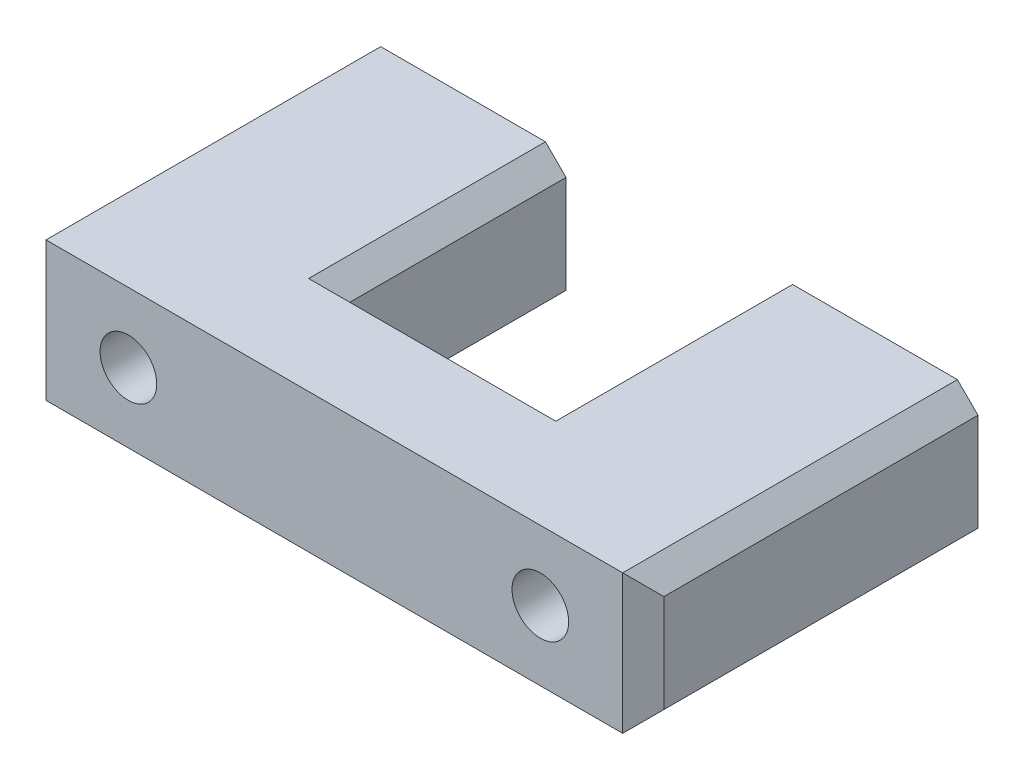
ISO-10303-21;
HEADER;
FILE_DESCRIPTION(('STEP AP214'),'2;1');
FILE_NAME('part.step','',(''),(''),'','','');
FILE_SCHEMA(('AUTOMOTIVE_DESIGN { 1 0 10303 214 1 1 1 1 }'));
ENDSEC;
DATA;
#1=APPLICATION_CONTEXT('core data for automotive mechanical design processes');
#2=APPLICATION_PROTOCOL_DEFINITION('international standard','automotive_design',2000,#1);
#3=PRODUCT_CONTEXT('',#1,'mechanical');
#4=PRODUCT('Part','Part','',(#3));
#5=PRODUCT_RELATED_PRODUCT_CATEGORY('part','',(#4));
#6=PRODUCT_DEFINITION_FORMATION('','',#4);
#7=PRODUCT_DEFINITION_CONTEXT('part definition',#1,'design');
#8=PRODUCT_DEFINITION('design','',#6,#7);
#9=PRODUCT_DEFINITION_SHAPE('','',#8);
#10=(LENGTH_UNIT() NAMED_UNIT(*) SI_UNIT(.MILLI.,.METRE.));
#11=(NAMED_UNIT(*) PLANE_ANGLE_UNIT() SI_UNIT($,.RADIAN.));
#12=(NAMED_UNIT(*) SI_UNIT($,.STERADIAN.) SOLID_ANGLE_UNIT());
#13=UNCERTAINTY_MEASURE_WITH_UNIT(LENGTH_MEASURE(1.E-05),#10,'distance_accuracy_value','');
#14=(GEOMETRIC_REPRESENTATION_CONTEXT(3) GLOBAL_UNCERTAINTY_ASSIGNED_CONTEXT((#13)) GLOBAL_UNIT_ASSIGNED_CONTEXT((#10,
#11,#12)) REPRESENTATION_CONTEXT('',''));
#15=CARTESIAN_POINT('',(0.,0.,0.));
#16=DIRECTION('',(0.,0.,1.));
#17=DIRECTION('',(1.,0.,0.));
#18=AXIS2_PLACEMENT_3D('',#15,#16,#17);
#19=CARTESIAN_POINT('',(0.,0.,0.));
#20=DIRECTION('',(0.,0.,1.));
#21=DIRECTION('',(1.,0.,0.));
#22=AXIS2_PLACEMENT_3D('',#19,#20,#21);
#23=PLANE('',#22);
#24=CARTESIAN_POINT('',(20.,0.,0.));
#25=DIRECTION('',(0.,0.,1.));
#26=DIRECTION('',(1.,0.,0.));
#27=AXIS2_PLACEMENT_3D('',#24,#25,#26);
#28=CIRCLE('',#27,2.75);
#29=CARTESIAN_POINT('',(22.75,0.,0.));
#30=VERTEX_POINT('',#29);
#31=EDGE_CURVE('E345',#30,#30,#28,.T.);
#32=ORIENTED_EDGE('',*,*,#31,.T.);
#33=EDGE_LOOP('',(#32));
#34=FACE_BOUND('',#33,.T.);
#35=DIRECTION('',(1.,0.,0.));
#36=VECTOR('',#35,1.);
#37=CARTESIAN_POINT('',(-30.,-6.75,0.));
#38=LINE('',#37,#36);
#39=CARTESIAN_POINT('',(12.,-6.75,0.));
#40=VERTEX_POINT('',#39);
#41=CARTESIAN_POINT('',(28.,-6.75,0.));
#42=VERTEX_POINT('',#41);
#43=EDGE_CURVE('E198',#40,#42,#38,.T.);
#44=ORIENTED_EDGE('',*,*,#43,.F.);
#45=DIRECTION('',(0.707106781186546,-0.707106781186549,0.));
#46=VECTOR('',#45,1.);
#47=CARTESIAN_POINT('',(12.,-6.75,0.));
#48=LINE('',#47,#46);
#49=CARTESIAN_POINT('',(10.,-4.74999999999998,0.));
#50=VERTEX_POINT('',#49);
#51=EDGE_CURVE('E285',#40,#50,#48,.F.);
#52=ORIENTED_EDGE('',*,*,#51,.T.);
#53=DIRECTION('',(0.,1.,0.));
#54=VECTOR('',#53,1.);
#55=CARTESIAN_POINT('',(10.,-6.75,0.));
#56=LINE('',#55,#54);
#57=CARTESIAN_POINT('',(10.,4.74999999999999,0.));
#58=VERTEX_POINT('',#57);
#59=EDGE_CURVE('E251',#50,#58,#56,.T.);
#60=ORIENTED_EDGE('',*,*,#59,.T.);
#61=DIRECTION('',(-0.707106781186549,-0.707106781186546,0.));
#62=VECTOR('',#61,1.);
#63=CARTESIAN_POINT('',(10.,4.74999999999999,0.));
#64=LINE('',#63,#62);
#65=CARTESIAN_POINT('',(12.,6.75,0.));
#66=VERTEX_POINT('',#65);
#67=EDGE_CURVE('E282',#58,#66,#64,.F.);
#68=ORIENTED_EDGE('',*,*,#67,.T.);
#69=DIRECTION('',(-1.,0.,0.));
#70=VECTOR('',#69,1.);
#71=CARTESIAN_POINT('',(-30.,6.75,0.));
#72=LINE('',#71,#70);
#73=CARTESIAN_POINT('',(28.,6.75,0.));
#74=VERTEX_POINT('',#73);
#75=EDGE_CURVE('E360',#74,#66,#72,.T.);
#76=ORIENTED_EDGE('',*,*,#75,.F.);
#77=DIRECTION('',(-0.707106781186546,0.707106781186549,0.));
#78=VECTOR('',#77,1.);
#79=CARTESIAN_POINT('',(28.,6.75,0.));
#80=LINE('',#79,#78);
#81=CARTESIAN_POINT('',(30.,4.74999999999998,0.));
#82=VERTEX_POINT('',#81);
#83=EDGE_CURVE('E174',#74,#82,#80,.F.);
#84=ORIENTED_EDGE('',*,*,#83,.T.);
#85=DIRECTION('',(0.,1.,0.));
#86=VECTOR('',#85,1.);
#87=CARTESIAN_POINT('',(30.,-6.75,0.));
#88=LINE('',#87,#86);
#89=CARTESIAN_POINT('',(30.,-4.74999999999998,0.));
#90=VERTEX_POINT('',#89);
#91=EDGE_CURVE('E179',#90,#82,#88,.T.);
#92=ORIENTED_EDGE('',*,*,#91,.F.);
#93=DIRECTION('',(0.707106781186546,0.707106781186549,0.));
#94=VECTOR('',#93,1.);
#95=CARTESIAN_POINT('',(30.,-4.74999999999998,0.));
#96=LINE('',#95,#94);
#97=EDGE_CURVE('E163',#90,#42,#96,.F.);
#98=ORIENTED_EDGE('',*,*,#97,.T.);
#99=EDGE_LOOP('',(#44,#52,#60,#68,#76,#84,#92,#98));
#100=FACE_BOUND('',#99,.T.);
#101=ADVANCED_FACE('F47',(#34,#100),#23,.F.);
#102=CARTESIAN_POINT('',(0.,0.,32.5));
#103=DIRECTION('',(0.,0.,1.));
#104=DIRECTION('',(1.,0.,0.));
#105=AXIS2_PLACEMENT_3D('',#102,#103,#104);
#106=PLANE('',#105);
#107=CARTESIAN_POINT('',(-20.,0.,32.5));
#108=DIRECTION('',(0.,0.,1.));
#109=DIRECTION('',(1.,0.,0.));
#110=AXIS2_PLACEMENT_3D('',#107,#108,#109);
#111=CIRCLE('',#110,2.75);
#112=CARTESIAN_POINT('',(-17.25,0.,32.5));
#113=VERTEX_POINT('',#112);
#114=EDGE_CURVE('E349',#113,#113,#111,.T.);
#115=ORIENTED_EDGE('',*,*,#114,.F.);
#116=EDGE_LOOP('',(#115));
#117=FACE_BOUND('',#116,.T.);
#118=DIRECTION('',(1.,0.,0.));
#119=VECTOR('',#118,1.);
#120=CARTESIAN_POINT('',(-30.,-6.75,32.5));
#121=LINE('',#120,#119);
#122=CARTESIAN_POINT('',(-28.,-6.75,32.5));
#123=VERTEX_POINT('',#122);
#124=CARTESIAN_POINT('',(28.,-6.75,32.5));
#125=VERTEX_POINT('',#124);
#126=EDGE_CURVE('E195',#123,#125,#121,.T.);
#127=ORIENTED_EDGE('',*,*,#126,.T.);
#128=DIRECTION('',(0.,1.,0.));
#129=VECTOR('',#128,1.);
#130=CARTESIAN_POINT('',(28.,6.75,32.5));
#131=LINE('',#130,#129);
#132=CARTESIAN_POINT('',(28.,6.75,32.5));
#133=VERTEX_POINT('',#132);
#134=EDGE_CURVE('E217',#125,#133,#131,.T.);
#135=ORIENTED_EDGE('',*,*,#134,.T.);
#136=DIRECTION('',(-1.,0.,0.));
#137=VECTOR('',#136,1.);
#138=CARTESIAN_POINT('',(-30.,6.75,32.5));
#139=LINE('',#138,#137);
#140=CARTESIAN_POINT('',(-28.,6.75,32.5));
#141=VERTEX_POINT('',#140);
#142=EDGE_CURVE('E189',#133,#141,#139,.T.);
#143=ORIENTED_EDGE('',*,*,#142,.T.);
#144=DIRECTION('',(0.,-1.,0.));
#145=VECTOR('',#144,1.);
#146=CARTESIAN_POINT('',(-28.,-6.75,32.5));
#147=LINE('',#146,#145);
#148=EDGE_CURVE('E214',#141,#123,#147,.T.);
#149=ORIENTED_EDGE('',*,*,#148,.T.);
#150=EDGE_LOOP('',(#127,#135,#143,#149));
#151=FACE_BOUND('',#150,.T.);
#152=CARTESIAN_POINT('',(20.,0.,32.5));
#153=DIRECTION('',(0.,0.,1.));
#154=DIRECTION('',(1.,0.,0.));
#155=AXIS2_PLACEMENT_3D('',#152,#153,#154);
#156=CIRCLE('',#155,2.75);
#157=CARTESIAN_POINT('',(22.75,0.,32.5));
#158=VERTEX_POINT('',#157);
#159=EDGE_CURVE('E340',#158,#158,#156,.T.);
#160=ORIENTED_EDGE('',*,*,#159,.F.);
#161=EDGE_LOOP('',(#160));
#162=FACE_BOUND('',#161,.T.);
#163=ADVANCED_FACE('F416',(#117,#151,#162),#106,.T.);
#164=DIRECTION('',(0.,1.,0.));
#165=VECTOR('',#164,1.);
#166=CARTESIAN_POINT('',(-10.,-6.75,0.));
#167=LINE('',#166,#165);
#168=CARTESIAN_POINT('',(-10.,-4.74999999999998,0.));
#169=VERTEX_POINT('',#168);
#170=CARTESIAN_POINT('',(-10.,4.74999999999999,0.));
#171=VERTEX_POINT('',#170);
#172=EDGE_CURVE('E332',#169,#171,#167,.T.);
#173=ORIENTED_EDGE('',*,*,#172,.F.);
#174=DIRECTION('',(0.707106781186546,0.707106781186549,0.));
#175=VECTOR('',#174,1.);
#176=CARTESIAN_POINT('',(-12.,-6.74999999999999,0.));
#177=LINE('',#176,#175);
#178=CARTESIAN_POINT('',(-12.,-6.75,0.));
#179=VERTEX_POINT('',#178);
#180=EDGE_CURVE('E279',#169,#179,#177,.F.);
#181=ORIENTED_EDGE('',*,*,#180,.T.);
#182=CARTESIAN_POINT('',(-28.,-6.75,0.));
#183=VERTEX_POINT('',#182);
#184=EDGE_CURVE('E190',#183,#179,#38,.T.);
#185=ORIENTED_EDGE('',*,*,#184,.F.);
#186=DIRECTION('',(0.707106781186549,-0.707106781186546,0.));
#187=VECTOR('',#186,1.);
#188=CARTESIAN_POINT('',(-28.,-6.75,0.));
#189=LINE('',#188,#187);
#190=CARTESIAN_POINT('',(-30.,-4.74999999999999,0.));
#191=VERTEX_POINT('',#190);
#192=EDGE_CURVE('E230',#183,#191,#189,.F.);
#193=ORIENTED_EDGE('',*,*,#192,.T.);
#194=DIRECTION('',(0.,-1.,0.));
#195=VECTOR('',#194,1.);
#196=CARTESIAN_POINT('',(-30.,-6.75,0.));
#197=LINE('',#196,#195);
#198=CARTESIAN_POINT('',(-30.,4.74999999999999,0.));
#199=VERTEX_POINT('',#198);
#200=EDGE_CURVE('E362',#199,#191,#197,.T.);
#201=ORIENTED_EDGE('',*,*,#200,.F.);
#202=DIRECTION('',(-0.707106781186549,-0.707106781186546,0.));
#203=VECTOR('',#202,1.);
#204=CARTESIAN_POINT('',(-30.,4.74999999999999,0.));
#205=LINE('',#204,#203);
#206=CARTESIAN_POINT('',(-28.,6.75,0.));
#207=VERTEX_POINT('',#206);
#208=EDGE_CURVE('E226',#199,#207,#205,.F.);
#209=ORIENTED_EDGE('',*,*,#208,.T.);
#210=CARTESIAN_POINT('',(-12.,6.75,0.));
#211=VERTEX_POINT('',#210);
#212=EDGE_CURVE('E353',#211,#207,#72,.T.);
#213=ORIENTED_EDGE('',*,*,#212,.F.);
#214=DIRECTION('',(-0.707106781186549,0.707106781186546,0.));
#215=VECTOR('',#214,1.);
#216=CARTESIAN_POINT('',(-10.,4.74999999999999,0.));
#217=LINE('',#216,#215);
#218=EDGE_CURVE('E276',#211,#171,#217,.F.);
#219=ORIENTED_EDGE('',*,*,#218,.T.);
#220=EDGE_LOOP('',(#173,#181,#185,#193,#201,#209,#213,#219));
#221=FACE_BOUND('',#220,.T.);
#222=CARTESIAN_POINT('',(-20.,0.,0.));
#223=DIRECTION('',(0.,0.,1.));
#224=DIRECTION('',(1.,0.,0.));
#225=AXIS2_PLACEMENT_3D('',#222,#223,#224);
#226=CIRCLE('',#225,2.75);
#227=CARTESIAN_POINT('',(-17.25,0.,0.));
#228=VERTEX_POINT('',#227);
#229=EDGE_CURVE('E344',#228,#228,#226,.T.);
#230=ORIENTED_EDGE('',*,*,#229,.T.);
#231=EDGE_LOOP('',(#230));
#232=FACE_BOUND('',#231,.T.);
#233=ADVANCED_FACE('F399',(#221,#232),#23,.F.);
#234=CARTESIAN_POINT('',(-30.,6.75,32.5));
#235=DIRECTION('',(0.,-1.,0.));
#236=DIRECTION('',(0.,0.,-1.));
#237=AXIS2_PLACEMENT_3D('',#234,#235,#236);
#238=PLANE('',#237);
#239=DIRECTION('',(-1.,0.,0.));
#240=VECTOR('',#239,1.);
#241=CARTESIAN_POINT('',(-30.,6.75,23.));
#242=LINE('',#241,#240);
#243=CARTESIAN_POINT('',(12.,6.75,23.));
#244=VERTEX_POINT('',#243);
#245=CARTESIAN_POINT('',(-12.,6.75,23.));
#246=VERTEX_POINT('',#245);
#247=EDGE_CURVE('E58',#244,#246,#242,.T.);
#248=ORIENTED_EDGE('',*,*,#247,.T.);
#249=DIRECTION('',(0.,0.,-1.));
#250=VECTOR('',#249,1.);
#251=CARTESIAN_POINT('',(-12.,6.75,32.5));
#252=LINE('',#251,#250);
#253=EDGE_CURVE('E11',#246,#211,#252,.T.);
#254=ORIENTED_EDGE('',*,*,#253,.T.);
#255=ORIENTED_EDGE('',*,*,#212,.T.);
#256=DIRECTION('',(0.,0.,1.));
#257=VECTOR('',#256,1.);
#258=CARTESIAN_POINT('',(-28.,6.75,32.5));
#259=LINE('',#258,#257);
#260=EDGE_CURVE('E220',#207,#141,#259,.T.);
#261=ORIENTED_EDGE('',*,*,#260,.T.);
#262=ORIENTED_EDGE('',*,*,#142,.F.);
#263=DIRECTION('',(0.,0.,-1.));
#264=VECTOR('',#263,1.);
#265=CARTESIAN_POINT('',(28.,6.75,32.5));
#266=LINE('',#265,#264);
#267=EDGE_CURVE('E223',#133,#74,#266,.T.);
#268=ORIENTED_EDGE('',*,*,#267,.T.);
#269=ORIENTED_EDGE('',*,*,#75,.T.);
#270=DIRECTION('',(0.,0.,1.));
#271=VECTOR('',#270,1.);
#272=CARTESIAN_POINT('',(12.,6.75,32.5));
#273=LINE('',#272,#271);
#274=EDGE_CURVE('E69',#66,#244,#273,.T.);
#275=ORIENTED_EDGE('',*,*,#274,.T.);
#276=EDGE_LOOP('',(#248,#254,#255,#261,#262,#268,#269,#275));
#277=FACE_BOUND('',#276,.T.);
#278=ADVANCED_FACE('F404',(#277),#238,.F.);
#279=CARTESIAN_POINT('',(-30.,-6.75,32.5));
#280=DIRECTION('',(1.,0.,0.));
#281=DIRECTION('',(0.,0.,-1.));
#282=AXIS2_PLACEMENT_3D('',#279,#280,#281);
#283=PLANE('',#282);
#284=ORIENTED_EDGE('',*,*,#200,.T.);
#285=DIRECTION('',(0.,0.,1.));
#286=VECTOR('',#285,1.);
#287=CARTESIAN_POINT('',(-30.,-4.74999999999999,32.5));
#288=LINE('',#287,#286);
#289=CARTESIAN_POINT('',(-30.,-4.74999999999999,30.5));
#290=VERTEX_POINT('',#289);
#291=EDGE_CURVE('E239',#191,#290,#288,.T.);
#292=ORIENTED_EDGE('',*,*,#291,.T.);
#293=DIRECTION('',(0.,1.,0.));
#294=VECTOR('',#293,1.);
#295=CARTESIAN_POINT('',(-30.,6.75,30.5));
#296=LINE('',#295,#294);
#297=CARTESIAN_POINT('',(-30.,4.74999999999999,30.5));
#298=VERTEX_POINT('',#297);
#299=EDGE_CURVE('E236',#290,#298,#296,.T.);
#300=ORIENTED_EDGE('',*,*,#299,.T.);
#301=DIRECTION('',(0.,0.,-1.));
#302=VECTOR('',#301,1.);
#303=CARTESIAN_POINT('',(-30.,4.74999999999999,32.5));
#304=LINE('',#303,#302);
#305=EDGE_CURVE('E233',#298,#199,#304,.T.);
#306=ORIENTED_EDGE('',*,*,#305,.T.);
#307=EDGE_LOOP('',(#284,#292,#300,#306));
#308=FACE_BOUND('',#307,.T.);
#309=ADVANCED_FACE('F449',(#308),#283,.F.);
#310=CARTESIAN_POINT('',(-30.,-6.75,32.5));
#311=DIRECTION('',(0.,1.,0.));
#312=DIRECTION('',(0.,0.,1.));
#313=AXIS2_PLACEMENT_3D('',#310,#311,#312);
#314=PLANE('',#313);
#315=ORIENTED_EDGE('',*,*,#184,.T.);
#316=DIRECTION('',(0.,0.,1.));
#317=VECTOR('',#316,1.);
#318=CARTESIAN_POINT('',(-12.,-6.75,32.5));
#319=LINE('',#318,#317);
#320=CARTESIAN_POINT('',(-12.,-6.75,23.));
#321=VERTEX_POINT('',#320);
#322=EDGE_CURVE('E265',#179,#321,#319,.T.);
#323=ORIENTED_EDGE('',*,*,#322,.T.);
#324=DIRECTION('',(1.,0.,0.));
#325=VECTOR('',#324,1.);
#326=CARTESIAN_POINT('',(-30.,-6.75,23.));
#327=LINE('',#326,#325);
#328=CARTESIAN_POINT('',(12.,-6.75,23.));
#329=VERTEX_POINT('',#328);
#330=EDGE_CURVE('E242',#321,#329,#327,.T.);
#331=ORIENTED_EDGE('',*,*,#330,.T.);
#332=DIRECTION('',(0.,0.,-1.));
#333=VECTOR('',#332,1.);
#334=CARTESIAN_POINT('',(12.,-6.75,32.5));
#335=LINE('',#334,#333);
#336=EDGE_CURVE('E262',#329,#40,#335,.T.);
#337=ORIENTED_EDGE('',*,*,#336,.T.);
#338=ORIENTED_EDGE('',*,*,#43,.T.);
#339=DIRECTION('',(0.,0.,1.));
#340=VECTOR('',#339,1.);
#341=CARTESIAN_POINT('',(28.,-6.75,32.5));
#342=LINE('',#341,#340);
#343=EDGE_CURVE('E168',#42,#125,#342,.T.);
#344=ORIENTED_EDGE('',*,*,#343,.T.);
#345=ORIENTED_EDGE('',*,*,#126,.F.);
#346=DIRECTION('',(0.,0.,-1.));
#347=VECTOR('',#346,1.);
#348=CARTESIAN_POINT('',(-28.,-6.75,32.5));
#349=LINE('',#348,#347);
#350=EDGE_CURVE('E173',#123,#183,#349,.T.);
#351=ORIENTED_EDGE('',*,*,#350,.T.);
#352=EDGE_LOOP('',(#315,#323,#331,#337,#338,#344,#345,#351));
#353=FACE_BOUND('',#352,.T.);
#354=ADVANCED_FACE('F370',(#353),#314,.F.);
#355=CARTESIAN_POINT('',(30.,-6.75,32.5));
#356=DIRECTION('',(-1.,0.,0.));
#357=DIRECTION('',(0.,0.,1.));
#358=AXIS2_PLACEMENT_3D('',#355,#356,#357);
#359=PLANE('',#358);
#360=DIRECTION('',(0.,-1.,0.));
#361=VECTOR('',#360,1.);
#362=CARTESIAN_POINT('',(30.,-6.75,30.5));
#363=LINE('',#362,#361);
#364=CARTESIAN_POINT('',(30.,4.74999999999998,30.5));
#365=VERTEX_POINT('',#364);
#366=CARTESIAN_POINT('',(30.,-4.74999999999998,30.5));
#367=VERTEX_POINT('',#366);
#368=EDGE_CURVE('E182',#365,#367,#363,.T.);
#369=ORIENTED_EDGE('',*,*,#368,.T.);
#370=DIRECTION('',(0.,0.,-1.));
#371=VECTOR('',#370,1.);
#372=CARTESIAN_POINT('',(30.,-4.74999999999998,32.5));
#373=LINE('',#372,#371);
#374=EDGE_CURVE('E167',#367,#90,#373,.T.);
#375=ORIENTED_EDGE('',*,*,#374,.T.);
#376=ORIENTED_EDGE('',*,*,#91,.T.);
#377=DIRECTION('',(0.,0.,1.));
#378=VECTOR('',#377,1.);
#379=CARTESIAN_POINT('',(30.,4.74999999999998,32.5));
#380=LINE('',#379,#378);
#381=EDGE_CURVE('E202',#82,#365,#380,.T.);
#382=ORIENTED_EDGE('',*,*,#381,.T.);
#383=EDGE_LOOP('',(#369,#375,#376,#382));
#384=FACE_BOUND('',#383,.T.);
#385=ADVANCED_FACE('F178',(#384),#359,.F.);
#386=CARTESIAN_POINT('',(-20.,0.,32.5));
#387=DIRECTION('',(0.,0.,-1.));
#388=DIRECTION('',(-1.,0.,0.));
#389=AXIS2_PLACEMENT_3D('',#386,#387,#388);
#390=CYLINDRICAL_SURFACE('',#389,2.75);
#391=ORIENTED_EDGE('',*,*,#114,.T.);
#392=EDGE_LOOP('',(#391));
#393=FACE_BOUND('',#392,.T.);
#394=ORIENTED_EDGE('',*,*,#229,.F.);
#395=EDGE_LOOP('',(#394));
#396=FACE_BOUND('',#395,.T.);
#397=ADVANCED_FACE('F567',(#393,#396),#390,.F.);
#398=CARTESIAN_POINT('',(20.,0.,32.5));
#399=DIRECTION('',(0.,0.,-1.));
#400=DIRECTION('',(-1.,0.,0.));
#401=AXIS2_PLACEMENT_3D('',#398,#399,#400);
#402=CYLINDRICAL_SURFACE('',#401,2.75);
#403=ORIENTED_EDGE('',*,*,#159,.T.);
#404=EDGE_LOOP('',(#403));
#405=FACE_BOUND('',#404,.T.);
#406=ORIENTED_EDGE('',*,*,#31,.F.);
#407=EDGE_LOOP('',(#406));
#408=FACE_BOUND('',#407,.T.);
#409=ADVANCED_FACE('F546',(#405,#408),#402,.F.);
#410=CARTESIAN_POINT('',(10.,-6.75,0.));
#411=DIRECTION('',(1.,0.,0.));
#412=DIRECTION('',(0.,0.,-1.));
#413=AXIS2_PLACEMENT_3D('',#410,#411,#412);
#414=PLANE('',#413);
#415=ORIENTED_EDGE('',*,*,#59,.F.);
#416=DIRECTION('',(0.,0.,1.));
#417=VECTOR('',#416,1.);
#418=CARTESIAN_POINT('',(10.,-4.74999999999998,0.));
#419=LINE('',#418,#417);
#420=CARTESIAN_POINT('',(10.,-4.74999999999998,21.));
#421=VERTEX_POINT('',#420);
#422=EDGE_CURVE('E291',#50,#421,#419,.T.);
#423=ORIENTED_EDGE('',*,*,#422,.T.);
#424=DIRECTION('',(0.,1.,0.));
#425=VECTOR('',#424,1.);
#426=CARTESIAN_POINT('',(10.,-6.75,21.));
#427=LINE('',#426,#425);
#428=CARTESIAN_POINT('',(10.,4.74999999999999,21.));
#429=VERTEX_POINT('',#428);
#430=EDGE_CURVE('E329',#421,#429,#427,.T.);
#431=ORIENTED_EDGE('',*,*,#430,.T.);
#432=DIRECTION('',(0.,0.,-1.));
#433=VECTOR('',#432,1.);
#434=CARTESIAN_POINT('',(10.,4.74999999999999,0.));
#435=LINE('',#434,#433);
#436=EDGE_CURVE('E288',#429,#58,#435,.T.);
#437=ORIENTED_EDGE('',*,*,#436,.T.);
#438=EDGE_LOOP('',(#415,#423,#431,#437));
#439=FACE_BOUND('',#438,.T.);
#440=ADVANCED_FACE('F326',(#439),#414,.F.);
#441=CARTESIAN_POINT('',(10.,-6.75,21.));
#442=DIRECTION('',(0.,0.,1.));
#443=DIRECTION('',(1.,0.,0.));
#444=AXIS2_PLACEMENT_3D('',#441,#442,#443);
#445=PLANE('',#444);
#446=ORIENTED_EDGE('',*,*,#430,.F.);
#447=DIRECTION('',(-1.,0.,0.));
#448=VECTOR('',#447,1.);
#449=CARTESIAN_POINT('',(10.,-4.74999999999998,21.));
#450=LINE('',#449,#448);
#451=CARTESIAN_POINT('',(-9.99999999999999,-4.74999999999998,21.));
#452=VERTEX_POINT('',#451);
#453=EDGE_CURVE('E297',#421,#452,#450,.T.);
#454=ORIENTED_EDGE('',*,*,#453,.T.);
#455=DIRECTION('',(0.,1.,0.));
#456=VECTOR('',#455,1.);
#457=CARTESIAN_POINT('',(-9.99999999999999,-6.75,21.));
#458=LINE('',#457,#456);
#459=CARTESIAN_POINT('',(-9.99999999999999,4.74999999999999,21.));
#460=VERTEX_POINT('',#459);
#461=EDGE_CURVE('E336',#452,#460,#458,.T.);
#462=ORIENTED_EDGE('',*,*,#461,.T.);
#463=DIRECTION('',(1.,0.,0.));
#464=VECTOR('',#463,1.);
#465=CARTESIAN_POINT('',(10.,4.74999999999999,21.));
#466=LINE('',#465,#464);
#467=EDGE_CURVE('E294',#460,#429,#466,.T.);
#468=ORIENTED_EDGE('',*,*,#467,.T.);
#469=EDGE_LOOP('',(#446,#454,#462,#468));
#470=FACE_BOUND('',#469,.T.);
#471=ADVANCED_FACE('F378',(#470),#445,.F.);
#472=CARTESIAN_POINT('',(-10.,-6.75,0.));
#473=DIRECTION('',(-1.,0.,0.));
#474=DIRECTION('',(0.,0.,1.));
#475=AXIS2_PLACEMENT_3D('',#472,#473,#474);
#476=PLANE('',#475);
#477=ORIENTED_EDGE('',*,*,#461,.F.);
#478=DIRECTION('',(0.,0.,-1.));
#479=VECTOR('',#478,1.);
#480=CARTESIAN_POINT('',(-10.,-4.74999999999998,0.));
#481=LINE('',#480,#479);
#482=EDGE_CURVE('E273',#452,#169,#481,.T.);
#483=ORIENTED_EDGE('',*,*,#482,.T.);
#484=ORIENTED_EDGE('',*,*,#172,.T.);
#485=DIRECTION('',(0.,0.,1.));
#486=VECTOR('',#485,1.);
#487=CARTESIAN_POINT('',(-10.,4.74999999999999,0.));
#488=LINE('',#487,#486);
#489=EDGE_CURVE('E269',#171,#460,#488,.T.);
#490=ORIENTED_EDGE('',*,*,#489,.T.);
#491=EDGE_LOOP('',(#477,#483,#484,#490));
#492=FACE_BOUND('',#491,.T.);
#493=ADVANCED_FACE('F386',(#492),#476,.F.);
#494=CARTESIAN_POINT('',(28.,6.75,32.5));
#495=DIRECTION('',(-0.707106781186549,-0.707106781186546,0.));
#496=DIRECTION('',(0.,0.,-1.));
#497=AXIS2_PLACEMENT_3D('',#494,#495,#496);
#498=PLANE('',#497);
#499=ORIENTED_EDGE('',*,*,#83,.F.);
#500=ORIENTED_EDGE('',*,*,#267,.F.);
#501=DIRECTION('',(-0.577350269189624,0.577350269189626,0.577350269189626));
#502=VECTOR('',#501,1.);
#503=CARTESIAN_POINT('',(28.,6.75,32.5));
#504=LINE('',#503,#502);
#505=EDGE_CURVE('E246',#365,#133,#504,.T.);
#506=ORIENTED_EDGE('',*,*,#505,.F.);
#507=ORIENTED_EDGE('',*,*,#381,.F.);
#508=EDGE_LOOP('',(#499,#500,#506,#507));
#509=FACE_BOUND('',#508,.T.);
#510=ADVANCED_FACE('F423',(#509),#498,.F.);
#511=CARTESIAN_POINT('',(28.,0.,32.5));
#512=DIRECTION('',(0.707106781186549,0.,0.707106781186546));
#513=DIRECTION('',(0.,-1.,0.));
#514=AXIS2_PLACEMENT_3D('',#511,#512,#513);
#515=PLANE('',#514);
#516=ORIENTED_EDGE('',*,*,#505,.T.);
#517=ORIENTED_EDGE('',*,*,#134,.F.);
#518=DIRECTION('',(-0.577350269189624,-0.577350269189626,0.577350269189626));
#519=VECTOR('',#518,1.);
#520=CARTESIAN_POINT('',(30.25,-4.5,30.25));
#521=LINE('',#520,#519);
#522=EDGE_CURVE('E243',#367,#125,#521,.T.);
#523=ORIENTED_EDGE('',*,*,#522,.F.);
#524=ORIENTED_EDGE('',*,*,#368,.F.);
#525=EDGE_LOOP('',(#516,#517,#523,#524));
#526=FACE_BOUND('',#525,.T.);
#527=ADVANCED_FACE('F420',(#526),#515,.T.);
#528=CARTESIAN_POINT('',(30.,-4.74999999999998,32.5));
#529=DIRECTION('',(-0.707106781186549,0.707106781186546,0.));
#530=DIRECTION('',(0.,0.,-1.));
#531=AXIS2_PLACEMENT_3D('',#528,#529,#530);
#532=PLANE('',#531);
#533=ORIENTED_EDGE('',*,*,#522,.T.);
#534=ORIENTED_EDGE('',*,*,#343,.F.);
#535=ORIENTED_EDGE('',*,*,#97,.F.);
#536=ORIENTED_EDGE('',*,*,#374,.F.);
#537=EDGE_LOOP('',(#533,#534,#535,#536));
#538=FACE_BOUND('',#537,.T.);
#539=ADVANCED_FACE('F166',(#538),#532,.F.);
#540=CARTESIAN_POINT('',(-30.,4.74999999999999,32.5));
#541=DIRECTION('',(0.707106781186546,-0.707106781186549,0.));
#542=DIRECTION('',(0.,0.,-1.));
#543=AXIS2_PLACEMENT_3D('',#540,#541,#542);
#544=PLANE('',#543);
#545=ORIENTED_EDGE('',*,*,#208,.F.);
#546=ORIENTED_EDGE('',*,*,#305,.F.);
#547=DIRECTION('',(-0.577350269189627,-0.577350269189625,-0.577350269189625));
#548=VECTOR('',#547,1.);
#549=CARTESIAN_POINT('',(-29.3333333333333,5.41666666666666,31.1666666666667));
#550=LINE('',#549,#548);
#551=EDGE_CURVE('E247',#141,#298,#550,.T.);
#552=ORIENTED_EDGE('',*,*,#551,.F.);
#553=ORIENTED_EDGE('',*,*,#260,.F.);
#554=EDGE_LOOP('',(#545,#546,#552,#553));
#555=FACE_BOUND('',#554,.T.);
#556=ADVANCED_FACE('F411',(#555),#544,.F.);
#557=CARTESIAN_POINT('',(-28.,0.,32.5));
#558=DIRECTION('',(-0.707106781186546,0.,0.707106781186549));
#559=DIRECTION('',(0.,1.,0.));
#560=AXIS2_PLACEMENT_3D('',#557,#558,#559);
#561=PLANE('',#560);
#562=ORIENTED_EDGE('',*,*,#551,.T.);
#563=ORIENTED_EDGE('',*,*,#299,.F.);
#564=DIRECTION('',(-0.577350269189627,0.577350269189625,-0.577350269189625));
#565=VECTOR('',#564,1.);
#566=CARTESIAN_POINT('',(-30.25,-4.50000000000001,30.25));
#567=LINE('',#566,#565);
#568=EDGE_CURVE('E252',#123,#290,#567,.T.);
#569=ORIENTED_EDGE('',*,*,#568,.F.);
#570=ORIENTED_EDGE('',*,*,#148,.F.);
#571=EDGE_LOOP('',(#562,#563,#569,#570));
#572=FACE_BOUND('',#571,.T.);
#573=ADVANCED_FACE('F471',(#572),#561,.T.);
#574=CARTESIAN_POINT('',(-28.,-6.75,32.5));
#575=DIRECTION('',(0.707106781186546,0.707106781186549,0.));
#576=DIRECTION('',(0.,0.,-1.));
#577=AXIS2_PLACEMENT_3D('',#574,#575,#576);
#578=PLANE('',#577);
#579=ORIENTED_EDGE('',*,*,#568,.T.);
#580=ORIENTED_EDGE('',*,*,#291,.F.);
#581=ORIENTED_EDGE('',*,*,#192,.F.);
#582=ORIENTED_EDGE('',*,*,#350,.F.);
#583=EDGE_LOOP('',(#579,#580,#581,#582));
#584=FACE_BOUND('',#583,.T.);
#585=ADVANCED_FACE('F476',(#584),#578,.F.);
#586=CARTESIAN_POINT('',(12.,-6.75,32.5));
#587=DIRECTION('',(0.707106781186549,0.707106781186546,0.));
#588=DIRECTION('',(0.,0.,-1.));
#589=AXIS2_PLACEMENT_3D('',#586,#587,#588);
#590=PLANE('',#589);
#591=ORIENTED_EDGE('',*,*,#51,.F.);
#592=ORIENTED_EDGE('',*,*,#336,.F.);
#593=DIRECTION('',(0.577350269189625,-0.577350269189627,0.577350269189625));
#594=VECTOR('',#593,1.);
#595=CARTESIAN_POINT('',(15.1666666666667,-9.91666666666667,26.1666666666667));
#596=LINE('',#595,#594);
#597=EDGE_CURVE('E256',#421,#329,#596,.T.);
#598=ORIENTED_EDGE('',*,*,#597,.F.);
#599=ORIENTED_EDGE('',*,*,#422,.F.);
#600=EDGE_LOOP('',(#591,#592,#598,#599));
#601=FACE_BOUND('',#600,.T.);
#602=ADVANCED_FACE('F374',(#601),#590,.F.);
#603=CARTESIAN_POINT('',(-30.,-6.75,23.));
#604=DIRECTION('',(0.,0.707106781186546,0.707106781186549));
#605=DIRECTION('',(1.,0.,0.));
#606=AXIS2_PLACEMENT_3D('',#603,#604,#605);
#607=PLANE('',#606);
#608=ORIENTED_EDGE('',*,*,#597,.T.);
#609=ORIENTED_EDGE('',*,*,#330,.F.);
#610=DIRECTION('',(0.577350269189625,0.577350269189627,-0.577350269189626));
#611=VECTOR('',#610,1.);
#612=CARTESIAN_POINT('',(-15.1666666666667,-9.91666666666666,26.1666666666667));
#613=LINE('',#612,#611);
#614=EDGE_CURVE('E304',#452,#321,#613,.F.);
#615=ORIENTED_EDGE('',*,*,#614,.F.);
#616=ORIENTED_EDGE('',*,*,#453,.F.);
#617=EDGE_LOOP('',(#608,#609,#615,#616));
#618=FACE_BOUND('',#617,.T.);
#619=ADVANCED_FACE('F395',(#618),#607,.F.);
#620=CARTESIAN_POINT('',(-12.,-6.75,32.5));
#621=DIRECTION('',(-0.707106781186549,0.707106781186546,0.));
#622=DIRECTION('',(0.,0.,1.));
#623=AXIS2_PLACEMENT_3D('',#620,#621,#622);
#624=PLANE('',#623);
#625=ORIENTED_EDGE('',*,*,#180,.F.);
#626=ORIENTED_EDGE('',*,*,#482,.F.);
#627=ORIENTED_EDGE('',*,*,#614,.T.);
#628=ORIENTED_EDGE('',*,*,#322,.F.);
#629=EDGE_LOOP('',(#625,#626,#627,#628));
#630=FACE_BOUND('',#629,.T.);
#631=ADVANCED_FACE('F391',(#630),#624,.F.);
#632=CARTESIAN_POINT('',(10.,4.74999999999999,0.));
#633=DIRECTION('',(0.707106781186547,-0.707106781186549,0.));
#634=DIRECTION('',(0.,0.,-1.));
#635=AXIS2_PLACEMENT_3D('',#632,#633,#634);
#636=PLANE('',#635);
#637=ORIENTED_EDGE('',*,*,#67,.F.);
#638=ORIENTED_EDGE('',*,*,#436,.F.);
#639=DIRECTION('',(0.577350269189626,0.577350269189625,0.577350269189626));
#640=VECTOR('',#639,1.);
#641=CARTESIAN_POINT('',(10.,4.74999999999999,21.));
#642=LINE('',#641,#640);
#643=EDGE_CURVE('E52',#244,#429,#642,.F.);
#644=ORIENTED_EDGE('',*,*,#643,.F.);
#645=ORIENTED_EDGE('',*,*,#274,.F.);
#646=EDGE_LOOP('',(#637,#638,#644,#645));
#647=FACE_BOUND('',#646,.T.);
#648=ADVANCED_FACE('F50',(#647),#636,.F.);
#649=CARTESIAN_POINT('',(10.,4.74999999999999,21.));
#650=DIRECTION('',(0.,-0.707106781186549,0.707106781186546));
#651=DIRECTION('',(1.,0.,0.));
#652=AXIS2_PLACEMENT_3D('',#649,#650,#651);
#653=PLANE('',#652);
#654=ORIENTED_EDGE('',*,*,#643,.T.);
#655=ORIENTED_EDGE('',*,*,#467,.F.);
#656=DIRECTION('',(-0.577350269189627,0.577350269189624,0.577350269189627));
#657=VECTOR('',#656,1.);
#658=CARTESIAN_POINT('',(-2.99999999999998,-2.25,14.));
#659=LINE('',#658,#657);
#660=EDGE_CURVE('E309',#246,#460,#659,.F.);
#661=ORIENTED_EDGE('',*,*,#660,.F.);
#662=ORIENTED_EDGE('',*,*,#247,.F.);
#663=EDGE_LOOP('',(#654,#655,#661,#662));
#664=FACE_BOUND('',#663,.T.);
#665=ADVANCED_FACE('F318',(#664),#653,.F.);
#666=CARTESIAN_POINT('',(-10.,4.74999999999999,0.));
#667=DIRECTION('',(-0.707106781186546,-0.707106781186549,0.));
#668=DIRECTION('',(0.,0.,1.));
#669=AXIS2_PLACEMENT_3D('',#666,#667,#668);
#670=PLANE('',#669);
#671=ORIENTED_EDGE('',*,*,#218,.F.);
#672=ORIENTED_EDGE('',*,*,#253,.F.);
#673=ORIENTED_EDGE('',*,*,#660,.T.);
#674=ORIENTED_EDGE('',*,*,#489,.F.);
#675=EDGE_LOOP('',(#671,#672,#673,#674));
#676=FACE_BOUND('',#675,.T.);
#677=ADVANCED_FACE('F403',(#676),#670,.F.);
#678=CLOSED_SHELL('',(#101,#163,#233,#278,#309,#354,#385,#397,#409,#440,#471,#493,#510,#527,
#539,#556,#573,#585,#602,#619,#631,#648,#665,#677));
#679=MANIFOLD_SOLID_BREP('B2',#678);
#680=ADVANCED_BREP_SHAPE_REPRESENTATION('',(#18,#679),#14);
#681=SHAPE_DEFINITION_REPRESENTATION(#9,#680);
ENDSEC;
END-ISO-10303-21;
